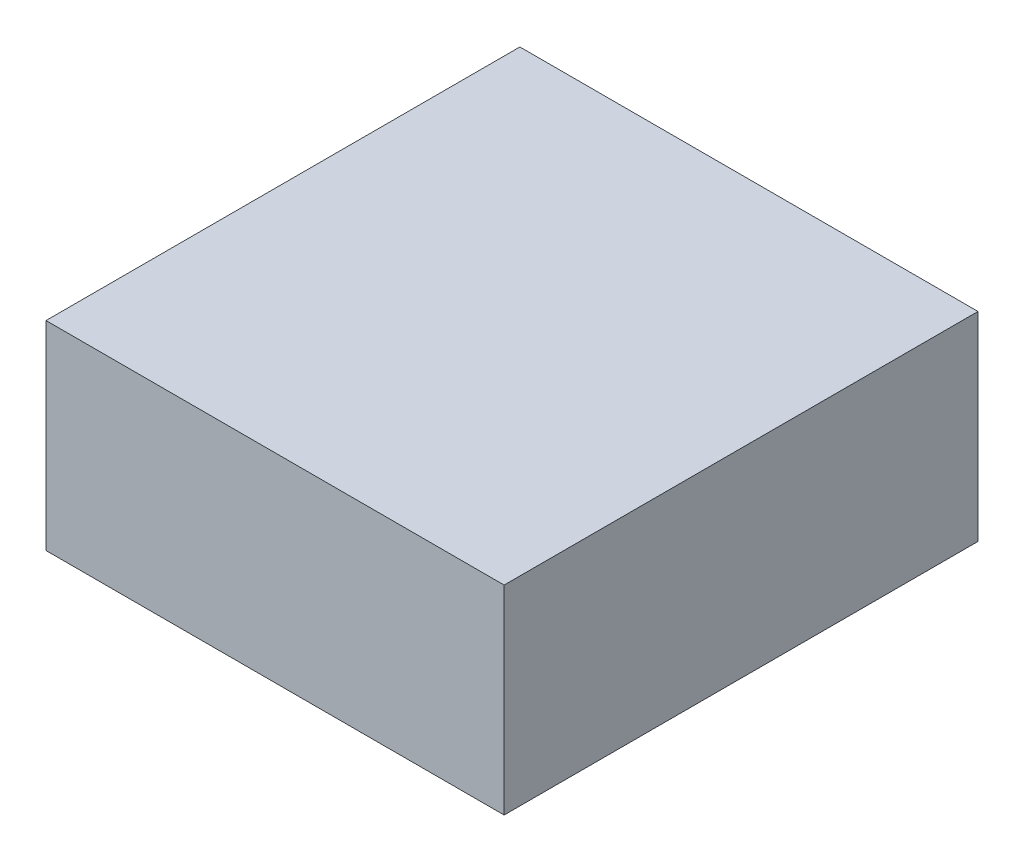
ISO-10303-21;
HEADER;
FILE_DESCRIPTION(('STEP AP214'),'2;1');
FILE_NAME('part.step','',(''),(''),'','','');
FILE_SCHEMA(('AUTOMOTIVE_DESIGN { 1 0 10303 214 1 1 1 1 }'));
ENDSEC;
DATA;
#1=APPLICATION_CONTEXT('core data for automotive mechanical design processes');
#2=APPLICATION_PROTOCOL_DEFINITION('international standard','automotive_design',2000,#1);
#3=PRODUCT_CONTEXT('',#1,'mechanical');
#4=PRODUCT('Part','Part','',(#3));
#5=PRODUCT_RELATED_PRODUCT_CATEGORY('part','',(#4));
#6=PRODUCT_DEFINITION_FORMATION('','',#4);
#7=PRODUCT_DEFINITION_CONTEXT('part definition',#1,'design');
#8=PRODUCT_DEFINITION('design','',#6,#7);
#9=PRODUCT_DEFINITION_SHAPE('','',#8);
#10=(LENGTH_UNIT() NAMED_UNIT(*) SI_UNIT(.MILLI.,.METRE.));
#11=(NAMED_UNIT(*) PLANE_ANGLE_UNIT() SI_UNIT($,.RADIAN.));
#12=(NAMED_UNIT(*) SI_UNIT($,.STERADIAN.) SOLID_ANGLE_UNIT());
#13=UNCERTAINTY_MEASURE_WITH_UNIT(LENGTH_MEASURE(1.E-05),#10,'distance_accuracy_value','');
#14=(GEOMETRIC_REPRESENTATION_CONTEXT(3) GLOBAL_UNCERTAINTY_ASSIGNED_CONTEXT((#13)) GLOBAL_UNIT_ASSIGNED_CONTEXT((#10,
#11,#12)) REPRESENTATION_CONTEXT('',''));
#15=CARTESIAN_POINT('',(0.,0.,0.));
#16=DIRECTION('',(0.,0.,1.));
#17=DIRECTION('',(1.,0.,0.));
#18=AXIS2_PLACEMENT_3D('',#15,#16,#17);
#19=CARTESIAN_POINT('',(0.,0.,114.808));
#20=DIRECTION('',(1.,0.,0.));
#21=DIRECTION('',(0.,0.,-1.));
#22=AXIS2_PLACEMENT_3D('',#19,#20,#21);
#23=PLANE('',#22);
#24=DIRECTION('',(0.,-1.,0.));
#25=VECTOR('',#24,1.);
#26=CARTESIAN_POINT('',(0.,0.,0.));
#27=LINE('',#26,#25);
#28=CARTESIAN_POINT('',(0.,48.26,0.));
#29=VERTEX_POINT('',#28);
#30=CARTESIAN_POINT('',(0.,0.,0.));
#31=VERTEX_POINT('',#30);
#32=EDGE_CURVE('E107',#29,#31,#27,.T.);
#33=ORIENTED_EDGE('',*,*,#32,.T.);
#34=DIRECTION('',(0.,0.,-1.));
#35=VECTOR('',#34,1.);
#36=CARTESIAN_POINT('',(0.,0.,114.808));
#37=LINE('',#36,#35);
#38=CARTESIAN_POINT('',(0.,0.,114.808));
#39=VERTEX_POINT('',#38);
#40=EDGE_CURVE('E11',#39,#31,#37,.T.);
#41=ORIENTED_EDGE('',*,*,#40,.F.);
#42=DIRECTION('',(0.,-1.,0.));
#43=VECTOR('',#42,1.);
#44=CARTESIAN_POINT('',(0.,0.,114.808));
#45=LINE('',#44,#43);
#46=CARTESIAN_POINT('',(0.,48.26,114.808));
#47=VERTEX_POINT('',#46);
#48=EDGE_CURVE('E91',#47,#39,#45,.T.);
#49=ORIENTED_EDGE('',*,*,#48,.F.);
#50=DIRECTION('',(0.,0.,-1.));
#51=VECTOR('',#50,1.);
#52=CARTESIAN_POINT('',(0.,48.26,114.808));
#53=LINE('',#52,#51);
#54=EDGE_CURVE('E103',#47,#29,#53,.T.);
#55=ORIENTED_EDGE('',*,*,#54,.T.);
#56=EDGE_LOOP('',(#33,#41,#49,#55));
#57=FACE_BOUND('',#56,.T.);
#58=ADVANCED_FACE('F39',(#57),#23,.F.);
#59=CARTESIAN_POINT('',(0.,0.,114.808));
#60=DIRECTION('',(0.,1.,0.));
#61=DIRECTION('',(0.,0.,1.));
#62=AXIS2_PLACEMENT_3D('',#59,#60,#61);
#63=PLANE('',#62);
#64=DIRECTION('',(1.,0.,0.));
#65=VECTOR('',#64,1.);
#66=CARTESIAN_POINT('',(0.,0.,0.));
#67=LINE('',#66,#65);
#68=CARTESIAN_POINT('',(110.998,0.,0.));
#69=VERTEX_POINT('',#68);
#70=EDGE_CURVE('E96',#31,#69,#67,.T.);
#71=ORIENTED_EDGE('',*,*,#70,.T.);
#72=DIRECTION('',(0.,0.,-1.));
#73=VECTOR('',#72,1.);
#74=CARTESIAN_POINT('',(110.998,0.,114.808));
#75=LINE('',#74,#73);
#76=CARTESIAN_POINT('',(110.998,0.,114.808));
#77=VERTEX_POINT('',#76);
#78=EDGE_CURVE('E48',#77,#69,#75,.T.);
#79=ORIENTED_EDGE('',*,*,#78,.F.);
#80=DIRECTION('',(1.,0.,0.));
#81=VECTOR('',#80,1.);
#82=CARTESIAN_POINT('',(0.,0.,114.808));
#83=LINE('',#82,#81);
#84=EDGE_CURVE('E86',#39,#77,#83,.T.);
#85=ORIENTED_EDGE('',*,*,#84,.F.);
#86=ORIENTED_EDGE('',*,*,#40,.T.);
#87=EDGE_LOOP('',(#71,#79,#85,#86));
#88=FACE_BOUND('',#87,.T.);
#89=ADVANCED_FACE('F95',(#88),#63,.F.);
#90=CARTESIAN_POINT('',(110.998,0.,114.808));
#91=DIRECTION('',(-1.,0.,0.));
#92=DIRECTION('',(0.,0.,1.));
#93=AXIS2_PLACEMENT_3D('',#90,#91,#92);
#94=PLANE('',#93);
#95=DIRECTION('',(0.,1.,0.));
#96=VECTOR('',#95,1.);
#97=CARTESIAN_POINT('',(110.998,0.,0.));
#98=LINE('',#97,#96);
#99=CARTESIAN_POINT('',(110.998,48.26,0.));
#100=VERTEX_POINT('',#99);
#101=EDGE_CURVE('E73',#69,#100,#98,.T.);
#102=ORIENTED_EDGE('',*,*,#101,.T.);
#103=DIRECTION('',(0.,0.,-1.));
#104=VECTOR('',#103,1.);
#105=CARTESIAN_POINT('',(110.998,48.26,114.808));
#106=LINE('',#105,#104);
#107=CARTESIAN_POINT('',(110.998,48.26,114.808));
#108=VERTEX_POINT('',#107);
#109=EDGE_CURVE('E98',#108,#100,#106,.T.);
#110=ORIENTED_EDGE('',*,*,#109,.F.);
#111=DIRECTION('',(0.,1.,0.));
#112=VECTOR('',#111,1.);
#113=CARTESIAN_POINT('',(110.998,0.,114.808));
#114=LINE('',#113,#112);
#115=EDGE_CURVE('E89',#77,#108,#114,.T.);
#116=ORIENTED_EDGE('',*,*,#115,.F.);
#117=ORIENTED_EDGE('',*,*,#78,.T.);
#118=EDGE_LOOP('',(#102,#110,#116,#117));
#119=FACE_BOUND('',#118,.T.);
#120=ADVANCED_FACE('F99',(#119),#94,.F.);
#121=CARTESIAN_POINT('',(0.,48.26,114.808));
#122=DIRECTION('',(0.,-1.,0.));
#123=DIRECTION('',(0.,0.,-1.));
#124=AXIS2_PLACEMENT_3D('',#121,#122,#123);
#125=PLANE('',#124);
#126=DIRECTION('',(-1.,0.,0.));
#127=VECTOR('',#126,1.);
#128=CARTESIAN_POINT('',(0.,48.26,0.));
#129=LINE('',#128,#127);
#130=EDGE_CURVE('E79',#100,#29,#129,.T.);
#131=ORIENTED_EDGE('',*,*,#130,.T.);
#132=ORIENTED_EDGE('',*,*,#54,.F.);
#133=DIRECTION('',(-1.,0.,0.));
#134=VECTOR('',#133,1.);
#135=CARTESIAN_POINT('',(0.,48.26,114.808));
#136=LINE('',#135,#134);
#137=EDGE_CURVE('E56',#108,#47,#136,.T.);
#138=ORIENTED_EDGE('',*,*,#137,.F.);
#139=ORIENTED_EDGE('',*,*,#109,.T.);
#140=EDGE_LOOP('',(#131,#132,#138,#139));
#141=FACE_BOUND('',#140,.T.);
#142=ADVANCED_FACE('F120',(#141),#125,.F.);
#143=CARTESIAN_POINT('',(0.,0.,114.808));
#144=DIRECTION('',(0.,0.,-1.));
#145=DIRECTION('',(-1.,0.,0.));
#146=AXIS2_PLACEMENT_3D('',#143,#144,#145);
#147=PLANE('',#146);
#148=ORIENTED_EDGE('',*,*,#48,.T.);
#149=ORIENTED_EDGE('',*,*,#84,.T.);
#150=ORIENTED_EDGE('',*,*,#115,.T.);
#151=ORIENTED_EDGE('',*,*,#137,.T.);
#152=EDGE_LOOP('',(#148,#149,#150,#151));
#153=FACE_BOUND('',#152,.T.);
#154=ADVANCED_FACE('F87',(#153),#147,.F.);
#155=CARTESIAN_POINT('',(0.,0.,0.));
#156=DIRECTION('',(0.,0.,-1.));
#157=DIRECTION('',(-1.,0.,0.));
#158=AXIS2_PLACEMENT_3D('',#155,#156,#157);
#159=PLANE('',#158);
#160=ORIENTED_EDGE('',*,*,#32,.F.);
#161=ORIENTED_EDGE('',*,*,#130,.F.);
#162=ORIENTED_EDGE('',*,*,#101,.F.);
#163=ORIENTED_EDGE('',*,*,#70,.F.);
#164=EDGE_LOOP('',(#160,#161,#162,#163));
#165=FACE_BOUND('',#164,.T.);
#166=ADVANCED_FACE('F123',(#165),#159,.T.);
#167=CLOSED_SHELL('',(#58,#89,#120,#142,#154,#166));
#168=MANIFOLD_SOLID_BREP('B2',#167);
#169=ADVANCED_BREP_SHAPE_REPRESENTATION('',(#18,#168),#14);
#170=SHAPE_DEFINITION_REPRESENTATION(#9,#169);
ENDSEC;
END-ISO-10303-21;
